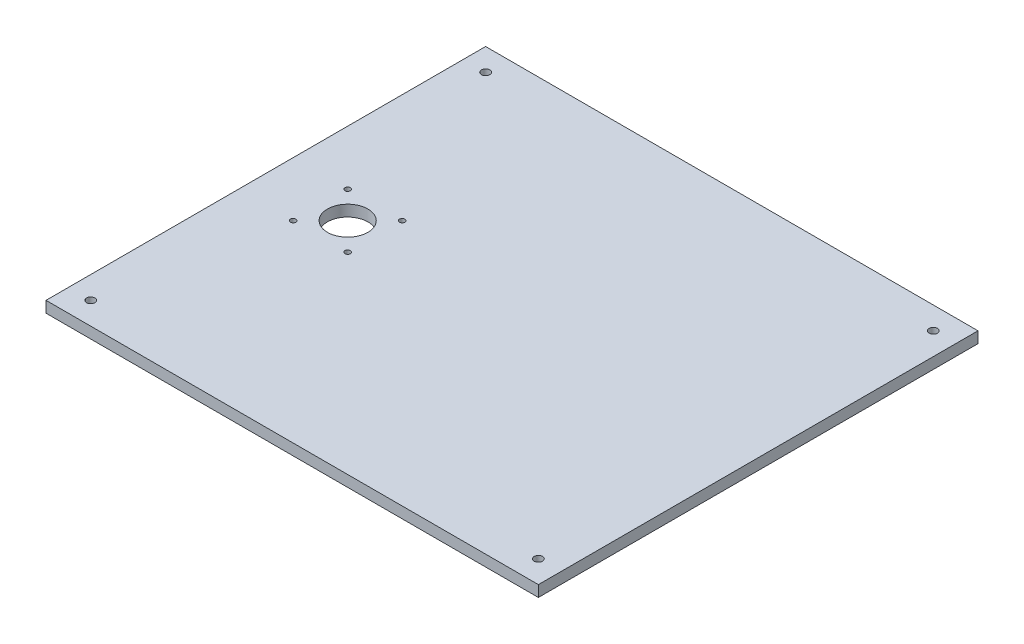
ISO-10303-21;
HEADER;
FILE_DESCRIPTION(('STEP AP214'),'2;1');
FILE_NAME('part.step','',(''),(''),'','','');
FILE_SCHEMA(('AUTOMOTIVE_DESIGN { 1 0 10303 214 1 1 1 1 }'));
ENDSEC;
DATA;
#1=APPLICATION_CONTEXT('core data for automotive mechanical design processes');
#2=APPLICATION_PROTOCOL_DEFINITION('international standard','automotive_design',2000,#1);
#3=PRODUCT_CONTEXT('',#1,'mechanical');
#4=PRODUCT('Part','Part','',(#3));
#5=PRODUCT_RELATED_PRODUCT_CATEGORY('part','',(#4));
#6=PRODUCT_DEFINITION_FORMATION('','',#4);
#7=PRODUCT_DEFINITION_CONTEXT('part definition',#1,'design');
#8=PRODUCT_DEFINITION('design','',#6,#7);
#9=PRODUCT_DEFINITION_SHAPE('','',#8);
#10=(LENGTH_UNIT() NAMED_UNIT(*) SI_UNIT(.MILLI.,.METRE.));
#11=(NAMED_UNIT(*) PLANE_ANGLE_UNIT() SI_UNIT($,.RADIAN.));
#12=(NAMED_UNIT(*) SI_UNIT($,.STERADIAN.) SOLID_ANGLE_UNIT());
#13=UNCERTAINTY_MEASURE_WITH_UNIT(LENGTH_MEASURE(1.E-05),#10,'distance_accuracy_value','');
#14=(GEOMETRIC_REPRESENTATION_CONTEXT(3) GLOBAL_UNCERTAINTY_ASSIGNED_CONTEXT((#13)) GLOBAL_UNIT_ASSIGNED_CONTEXT((#10,
#11,#12)) REPRESENTATION_CONTEXT('',''));
#15=CARTESIAN_POINT('',(0.,0.,0.));
#16=DIRECTION('',(0.,0.,1.));
#17=DIRECTION('',(1.,0.,0.));
#18=AXIS2_PLACEMENT_3D('',#15,#16,#17);
#19=CARTESIAN_POINT('',(140.,6.35,125.));
#20=DIRECTION('',(-1.,0.,0.));
#21=DIRECTION('',(0.,0.,1.));
#22=AXIS2_PLACEMENT_3D('',#19,#20,#21);
#23=PLANE('',#22);
#24=DIRECTION('',(0.,0.,-1.));
#25=VECTOR('',#24,1.);
#26=CARTESIAN_POINT('',(140.,0.,125.));
#27=LINE('',#26,#25);
#28=CARTESIAN_POINT('',(140.,0.,125.));
#29=VERTEX_POINT('',#28);
#30=CARTESIAN_POINT('',(140.,0.,-125.));
#31=VERTEX_POINT('',#30);
#32=EDGE_CURVE('E96',#29,#31,#27,.T.);
#33=ORIENTED_EDGE('',*,*,#32,.T.);
#34=DIRECTION('',(0.,-1.,0.));
#35=VECTOR('',#34,1.);
#36=CARTESIAN_POINT('',(140.,6.35,-125.));
#37=LINE('',#36,#35);
#38=CARTESIAN_POINT('',(140.,6.35,-125.));
#39=VERTEX_POINT('',#38);
#40=EDGE_CURVE('E11',#39,#31,#37,.T.);
#41=ORIENTED_EDGE('',*,*,#40,.F.);
#42=DIRECTION('',(0.,0.,-1.));
#43=VECTOR('',#42,1.);
#44=CARTESIAN_POINT('',(140.,6.35,125.));
#45=LINE('',#44,#43);
#46=CARTESIAN_POINT('',(140.,6.35,125.));
#47=VERTEX_POINT('',#46);
#48=EDGE_CURVE('E84',#47,#39,#45,.T.);
#49=ORIENTED_EDGE('',*,*,#48,.F.);
#50=DIRECTION('',(0.,-1.,0.));
#51=VECTOR('',#50,1.);
#52=CARTESIAN_POINT('',(140.,6.35,125.));
#53=LINE('',#52,#51);
#54=EDGE_CURVE('E92',#47,#29,#53,.T.);
#55=ORIENTED_EDGE('',*,*,#54,.T.);
#56=EDGE_LOOP('',(#33,#41,#49,#55));
#57=FACE_BOUND('',#56,.T.);
#58=ADVANCED_FACE('F33',(#57),#23,.F.);
#59=CARTESIAN_POINT('',(-140.,6.35,-125.));
#60=DIRECTION('',(0.,0.,1.));
#61=DIRECTION('',(1.,0.,0.));
#62=AXIS2_PLACEMENT_3D('',#59,#60,#61);
#63=PLANE('',#62);
#64=DIRECTION('',(-1.,0.,0.));
#65=VECTOR('',#64,1.);
#66=CARTESIAN_POINT('',(-140.,0.,-125.));
#67=LINE('',#66,#65);
#68=CARTESIAN_POINT('',(-140.,0.,-125.));
#69=VERTEX_POINT('',#68);
#70=EDGE_CURVE('E88',#31,#69,#67,.T.);
#71=ORIENTED_EDGE('',*,*,#70,.T.);
#72=DIRECTION('',(0.,-1.,0.));
#73=VECTOR('',#72,1.);
#74=CARTESIAN_POINT('',(-140.,6.35,-125.));
#75=LINE('',#74,#73);
#76=CARTESIAN_POINT('',(-140.,6.35,-125.));
#77=VERTEX_POINT('',#76);
#78=EDGE_CURVE('E41',#77,#69,#75,.T.);
#79=ORIENTED_EDGE('',*,*,#78,.F.);
#80=DIRECTION('',(-1.,0.,0.));
#81=VECTOR('',#80,1.);
#82=CARTESIAN_POINT('',(-140.,6.35,-125.));
#83=LINE('',#82,#81);
#84=EDGE_CURVE('E79',#39,#77,#83,.T.);
#85=ORIENTED_EDGE('',*,*,#84,.F.);
#86=ORIENTED_EDGE('',*,*,#40,.T.);
#87=EDGE_LOOP('',(#71,#79,#85,#86));
#88=FACE_BOUND('',#87,.T.);
#89=ADVANCED_FACE('F87',(#88),#63,.F.);
#90=CARTESIAN_POINT('',(-140.,6.35,125.));
#91=DIRECTION('',(1.,0.,0.));
#92=DIRECTION('',(0.,0.,-1.));
#93=AXIS2_PLACEMENT_3D('',#90,#91,#92);
#94=PLANE('',#93);
#95=DIRECTION('',(0.,0.,1.));
#96=VECTOR('',#95,1.);
#97=CARTESIAN_POINT('',(-140.,0.,125.));
#98=LINE('',#97,#96);
#99=CARTESIAN_POINT('',(-140.,0.,125.));
#100=VERTEX_POINT('',#99);
#101=EDGE_CURVE('E66',#69,#100,#98,.T.);
#102=ORIENTED_EDGE('',*,*,#101,.T.);
#103=DIRECTION('',(0.,-1.,0.));
#104=VECTOR('',#103,1.);
#105=CARTESIAN_POINT('',(-140.,6.35,125.));
#106=LINE('',#105,#104);
#107=CARTESIAN_POINT('',(-140.,6.35,125.));
#108=VERTEX_POINT('',#107);
#109=EDGE_CURVE('E89',#108,#100,#106,.T.);
#110=ORIENTED_EDGE('',*,*,#109,.F.);
#111=DIRECTION('',(0.,0.,1.));
#112=VECTOR('',#111,1.);
#113=CARTESIAN_POINT('',(-140.,6.35,125.));
#114=LINE('',#113,#112);
#115=EDGE_CURVE('E82',#77,#108,#114,.T.);
#116=ORIENTED_EDGE('',*,*,#115,.F.);
#117=ORIENTED_EDGE('',*,*,#78,.T.);
#118=EDGE_LOOP('',(#102,#110,#116,#117));
#119=FACE_BOUND('',#118,.T.);
#120=ADVANCED_FACE('F90',(#119),#94,.F.);
#121=CARTESIAN_POINT('',(-140.,6.35,125.));
#122=DIRECTION('',(0.,0.,-1.));
#123=DIRECTION('',(-1.,0.,0.));
#124=AXIS2_PLACEMENT_3D('',#121,#122,#123);
#125=PLANE('',#124);
#126=DIRECTION('',(1.,0.,0.));
#127=VECTOR('',#126,1.);
#128=CARTESIAN_POINT('',(-140.,0.,125.));
#129=LINE('',#128,#127);
#130=EDGE_CURVE('E72',#100,#29,#129,.T.);
#131=ORIENTED_EDGE('',*,*,#130,.T.);
#132=ORIENTED_EDGE('',*,*,#54,.F.);
#133=DIRECTION('',(1.,0.,0.));
#134=VECTOR('',#133,1.);
#135=CARTESIAN_POINT('',(-140.,6.35,125.));
#136=LINE('',#135,#134);
#137=EDGE_CURVE('E49',#108,#47,#136,.T.);
#138=ORIENTED_EDGE('',*,*,#137,.F.);
#139=ORIENTED_EDGE('',*,*,#109,.T.);
#140=EDGE_LOOP('',(#131,#132,#138,#139));
#141=FACE_BOUND('',#140,.T.);
#142=ADVANCED_FACE('F104',(#141),#125,.F.);
#143=CARTESIAN_POINT('',(0.,6.35,0.));
#144=DIRECTION('',(0.,-1.,0.));
#145=DIRECTION('',(0.,0.,-1.));
#146=AXIS2_PLACEMENT_3D('',#143,#144,#145);
#147=PLANE('',#146);
#148=CARTESIAN_POINT('',(-77.9499999999999,6.35,-15.5));
#149=DIRECTION('',(0.,1.,0.));
#150=DIRECTION('',(0.,0.,1.));
#151=AXIS2_PLACEMENT_3D('',#148,#149,#150);
#152=CIRCLE('',#151,1.54999999999999);
#153=CARTESIAN_POINT('',(-77.9499999999999,6.35,-13.95));
#154=VERTEX_POINT('',#153);
#155=EDGE_CURVE('E140',#154,#154,#152,.T.);
#156=ORIENTED_EDGE('',*,*,#155,.F.);
#157=EDGE_LOOP('',(#156));
#158=FACE_BOUND('',#157,.T.);
#159=CARTESIAN_POINT('',(-108.95,6.35,-15.5));
#160=DIRECTION('',(0.,1.,0.));
#161=DIRECTION('',(0.,0.,1.));
#162=AXIS2_PLACEMENT_3D('',#159,#160,#161);
#163=CIRCLE('',#162,1.54999999999999);
#164=CARTESIAN_POINT('',(-108.95,6.35,-13.95));
#165=VERTEX_POINT('',#164);
#166=EDGE_CURVE('E146',#165,#165,#163,.T.);
#167=ORIENTED_EDGE('',*,*,#166,.F.);
#168=EDGE_LOOP('',(#167));
#169=FACE_BOUND('',#168,.T.);
#170=CARTESIAN_POINT('',(-108.95,6.35,15.5));
#171=DIRECTION('',(0.,1.,0.));
#172=DIRECTION('',(0.,0.,1.));
#173=AXIS2_PLACEMENT_3D('',#170,#171,#172);
#174=CIRCLE('',#173,1.54999999999999);
#175=CARTESIAN_POINT('',(-108.95,6.35,17.05));
#176=VERTEX_POINT('',#175);
#177=EDGE_CURVE('E152',#176,#176,#174,.T.);
#178=ORIENTED_EDGE('',*,*,#177,.F.);
#179=EDGE_LOOP('',(#178));
#180=FACE_BOUND('',#179,.T.);
#181=CARTESIAN_POINT('',(-93.4499999999999,6.35,0.));
#182=DIRECTION('',(0.,1.,0.));
#183=DIRECTION('',(0.,0.,1.));
#184=AXIS2_PLACEMENT_3D('',#181,#182,#183);
#185=CIRCLE('',#184,11.5);
#186=CARTESIAN_POINT('',(-93.4499999999999,6.35,11.5));
#187=VERTEX_POINT('',#186);
#188=EDGE_CURVE('E158',#187,#187,#185,.T.);
#189=ORIENTED_EDGE('',*,*,#188,.F.);
#190=EDGE_LOOP('',(#189));
#191=FACE_BOUND('',#190,.T.);
#192=CARTESIAN_POINT('',(-77.9499999999999,6.35,15.5));
#193=DIRECTION('',(0.,1.,0.));
#194=DIRECTION('',(0.,0.,1.));
#195=AXIS2_PLACEMENT_3D('',#192,#193,#194);
#196=CIRCLE('',#195,1.55000000000001);
#197=CARTESIAN_POINT('',(-77.9499999999999,6.35,17.05));
#198=VERTEX_POINT('',#197);
#199=EDGE_CURVE('E134',#198,#198,#196,.T.);
#200=ORIENTED_EDGE('',*,*,#199,.F.);
#201=EDGE_LOOP('',(#200));
#202=FACE_BOUND('',#201,.T.);
#203=CARTESIAN_POINT('',(127.3,6.35,112.3));
#204=DIRECTION('',(0.,-1.,0.));
#205=DIRECTION('',(0.,0.,1.));
#206=AXIS2_PLACEMENT_3D('',#203,#204,#205);
#207=CIRCLE('',#206,2.38125);
#208=CARTESIAN_POINT('',(127.3,6.35,114.68125));
#209=VERTEX_POINT('',#208);
#210=EDGE_CURVE('E128',#209,#209,#207,.T.);
#211=ORIENTED_EDGE('',*,*,#210,.T.);
#212=EDGE_LOOP('',(#211));
#213=FACE_BOUND('',#212,.T.);
#214=CARTESIAN_POINT('',(127.3,6.35,-112.3));
#215=DIRECTION('',(0.,1.,0.));
#216=DIRECTION('',(0.,0.,-1.));
#217=AXIS2_PLACEMENT_3D('',#214,#215,#216);
#218=CIRCLE('',#217,2.38125);
#219=CARTESIAN_POINT('',(127.3,6.35,-114.68125));
#220=VERTEX_POINT('',#219);
#221=EDGE_CURVE('E122',#220,#220,#218,.T.);
#222=ORIENTED_EDGE('',*,*,#221,.F.);
#223=EDGE_LOOP('',(#222));
#224=FACE_BOUND('',#223,.T.);
#225=CARTESIAN_POINT('',(-127.3,6.35,-112.3));
#226=DIRECTION('',(0.,-1.,0.));
#227=DIRECTION('',(0.,0.,-1.));
#228=AXIS2_PLACEMENT_3D('',#225,#226,#227);
#229=CIRCLE('',#228,2.38125);
#230=CARTESIAN_POINT('',(-127.3,6.35,-114.68125));
#231=VERTEX_POINT('',#230);
#232=EDGE_CURVE('E116',#231,#231,#229,.T.);
#233=ORIENTED_EDGE('',*,*,#232,.T.);
#234=EDGE_LOOP('',(#233));
#235=FACE_BOUND('',#234,.T.);
#236=CARTESIAN_POINT('',(-127.3,6.35,112.3));
#237=DIRECTION('',(0.,1.,0.));
#238=DIRECTION('',(0.,0.,1.));
#239=AXIS2_PLACEMENT_3D('',#236,#237,#238);
#240=CIRCLE('',#239,2.38125);
#241=CARTESIAN_POINT('',(-127.3,6.35,114.68125));
#242=VERTEX_POINT('',#241);
#243=EDGE_CURVE('E110',#242,#242,#240,.T.);
#244=ORIENTED_EDGE('',*,*,#243,.F.);
#245=EDGE_LOOP('',(#244));
#246=FACE_BOUND('',#245,.T.);
#247=ORIENTED_EDGE('',*,*,#48,.T.);
#248=ORIENTED_EDGE('',*,*,#84,.T.);
#249=ORIENTED_EDGE('',*,*,#115,.T.);
#250=ORIENTED_EDGE('',*,*,#137,.T.);
#251=EDGE_LOOP('',(#247,#248,#249,#250));
#252=FACE_BOUND('',#251,.T.);
#253=ADVANCED_FACE('F80',(#158,#169,#180,#191,#202,#213,#224,#235,#246,#252),#147,.F.);
#254=CARTESIAN_POINT('',(0.,0.,0.));
#255=DIRECTION('',(0.,-1.,0.));
#256=DIRECTION('',(0.,0.,-1.));
#257=AXIS2_PLACEMENT_3D('',#254,#255,#256);
#258=PLANE('',#257);
#259=CARTESIAN_POINT('',(-77.9499999999999,0.,-15.5));
#260=DIRECTION('',(0.,1.,0.));
#261=DIRECTION('',(0.,0.,1.));
#262=AXIS2_PLACEMENT_3D('',#259,#260,#261);
#263=CIRCLE('',#262,1.54999999999999);
#264=CARTESIAN_POINT('',(-77.9499999999999,0.,-13.95));
#265=VERTEX_POINT('',#264);
#266=EDGE_CURVE('E143',#265,#265,#263,.T.);
#267=ORIENTED_EDGE('',*,*,#266,.T.);
#268=EDGE_LOOP('',(#267));
#269=FACE_BOUND('',#268,.T.);
#270=CARTESIAN_POINT('',(-108.95,0.,-15.5));
#271=DIRECTION('',(0.,1.,0.));
#272=DIRECTION('',(0.,0.,1.));
#273=AXIS2_PLACEMENT_3D('',#270,#271,#272);
#274=CIRCLE('',#273,1.54999999999999);
#275=CARTESIAN_POINT('',(-108.95,0.,-13.95));
#276=VERTEX_POINT('',#275);
#277=EDGE_CURVE('E149',#276,#276,#274,.T.);
#278=ORIENTED_EDGE('',*,*,#277,.T.);
#279=EDGE_LOOP('',(#278));
#280=FACE_BOUND('',#279,.T.);
#281=CARTESIAN_POINT('',(-108.95,0.,15.5));
#282=DIRECTION('',(0.,1.,0.));
#283=DIRECTION('',(0.,0.,1.));
#284=AXIS2_PLACEMENT_3D('',#281,#282,#283);
#285=CIRCLE('',#284,1.54999999999999);
#286=CARTESIAN_POINT('',(-108.95,0.,17.05));
#287=VERTEX_POINT('',#286);
#288=EDGE_CURVE('E155',#287,#287,#285,.T.);
#289=ORIENTED_EDGE('',*,*,#288,.T.);
#290=EDGE_LOOP('',(#289));
#291=FACE_BOUND('',#290,.T.);
#292=CARTESIAN_POINT('',(-93.4499999999999,0.,0.));
#293=DIRECTION('',(0.,1.,0.));
#294=DIRECTION('',(0.,0.,1.));
#295=AXIS2_PLACEMENT_3D('',#292,#293,#294);
#296=CIRCLE('',#295,11.5);
#297=CARTESIAN_POINT('',(-93.4499999999999,0.,11.5));
#298=VERTEX_POINT('',#297);
#299=EDGE_CURVE('E137',#298,#298,#296,.T.);
#300=ORIENTED_EDGE('',*,*,#299,.T.);
#301=EDGE_LOOP('',(#300));
#302=FACE_BOUND('',#301,.T.);
#303=CARTESIAN_POINT('',(-77.9499999999999,0.,15.5));
#304=DIRECTION('',(0.,1.,0.));
#305=DIRECTION('',(0.,0.,1.));
#306=AXIS2_PLACEMENT_3D('',#303,#304,#305);
#307=CIRCLE('',#306,1.55000000000001);
#308=CARTESIAN_POINT('',(-77.9499999999999,0.,17.05));
#309=VERTEX_POINT('',#308);
#310=EDGE_CURVE('E131',#309,#309,#307,.T.);
#311=ORIENTED_EDGE('',*,*,#310,.T.);
#312=EDGE_LOOP('',(#311));
#313=FACE_BOUND('',#312,.T.);
#314=CARTESIAN_POINT('',(127.3,0.,112.3));
#315=DIRECTION('',(0.,-1.,0.));
#316=DIRECTION('',(0.,0.,1.));
#317=AXIS2_PLACEMENT_3D('',#314,#315,#316);
#318=CIRCLE('',#317,2.38125);
#319=CARTESIAN_POINT('',(127.3,0.,114.68125));
#320=VERTEX_POINT('',#319);
#321=EDGE_CURVE('E125',#320,#320,#318,.T.);
#322=ORIENTED_EDGE('',*,*,#321,.F.);
#323=EDGE_LOOP('',(#322));
#324=FACE_BOUND('',#323,.T.);
#325=CARTESIAN_POINT('',(127.3,0.,-112.3));
#326=DIRECTION('',(0.,1.,0.));
#327=DIRECTION('',(0.,0.,-1.));
#328=AXIS2_PLACEMENT_3D('',#325,#326,#327);
#329=CIRCLE('',#328,2.38125);
#330=CARTESIAN_POINT('',(127.3,0.,-114.68125));
#331=VERTEX_POINT('',#330);
#332=EDGE_CURVE('E119',#331,#331,#329,.T.);
#333=ORIENTED_EDGE('',*,*,#332,.T.);
#334=EDGE_LOOP('',(#333));
#335=FACE_BOUND('',#334,.T.);
#336=CARTESIAN_POINT('',(-127.3,0.,-112.3));
#337=DIRECTION('',(0.,-1.,0.));
#338=DIRECTION('',(0.,0.,-1.));
#339=AXIS2_PLACEMENT_3D('',#336,#337,#338);
#340=CIRCLE('',#339,2.38125);
#341=CARTESIAN_POINT('',(-127.3,0.,-114.68125));
#342=VERTEX_POINT('',#341);
#343=EDGE_CURVE('E113',#342,#342,#340,.T.);
#344=ORIENTED_EDGE('',*,*,#343,.F.);
#345=EDGE_LOOP('',(#344));
#346=FACE_BOUND('',#345,.T.);
#347=CARTESIAN_POINT('',(-127.3,0.,112.3));
#348=DIRECTION('',(0.,1.,0.));
#349=DIRECTION('',(0.,0.,1.));
#350=AXIS2_PLACEMENT_3D('',#347,#348,#349);
#351=CIRCLE('',#350,2.38125);
#352=CARTESIAN_POINT('',(-127.3,0.,114.68125));
#353=VERTEX_POINT('',#352);
#354=EDGE_CURVE('E99',#353,#353,#351,.T.);
#355=ORIENTED_EDGE('',*,*,#354,.T.);
#356=EDGE_LOOP('',(#355));
#357=FACE_BOUND('',#356,.T.);
#358=ORIENTED_EDGE('',*,*,#32,.F.);
#359=ORIENTED_EDGE('',*,*,#130,.F.);
#360=ORIENTED_EDGE('',*,*,#101,.F.);
#361=ORIENTED_EDGE('',*,*,#70,.F.);
#362=EDGE_LOOP('',(#358,#359,#360,#361));
#363=FACE_BOUND('',#362,.T.);
#364=ADVANCED_FACE('F107',(#269,#280,#291,#302,#313,#324,#335,#346,#357,#363),#258,.T.);
#365=CARTESIAN_POINT('',(-127.3,0.,112.3));
#366=DIRECTION('',(0.,1.,0.));
#367=DIRECTION('',(0.,0.,1.));
#368=AXIS2_PLACEMENT_3D('',#365,#366,#367);
#369=CYLINDRICAL_SURFACE('',#368,2.38125);
#370=ORIENTED_EDGE('',*,*,#354,.F.);
#371=EDGE_LOOP('',(#370));
#372=FACE_BOUND('',#371,.T.);
#373=ORIENTED_EDGE('',*,*,#243,.T.);
#374=EDGE_LOOP('',(#373));
#375=FACE_BOUND('',#374,.T.);
#376=ADVANCED_FACE('F188',(#372,#375),#369,.F.);
#377=CARTESIAN_POINT('',(-127.3,0.,-112.3));
#378=DIRECTION('',(0.,1.,0.));
#379=DIRECTION('',(0.,0.,1.));
#380=AXIS2_PLACEMENT_3D('',#377,#378,#379);
#381=CYLINDRICAL_SURFACE('',#380,2.38125);
#382=ORIENTED_EDGE('',*,*,#343,.T.);
#383=EDGE_LOOP('',(#382));
#384=FACE_BOUND('',#383,.T.);
#385=ORIENTED_EDGE('',*,*,#232,.F.);
#386=EDGE_LOOP('',(#385));
#387=FACE_BOUND('',#386,.T.);
#388=ADVANCED_FACE('F190',(#384,#387),#381,.F.);
#389=CARTESIAN_POINT('',(127.3,0.,-112.3));
#390=DIRECTION('',(0.,1.,0.));
#391=DIRECTION('',(0.,0.,1.));
#392=AXIS2_PLACEMENT_3D('',#389,#390,#391);
#393=CYLINDRICAL_SURFACE('',#392,2.38125);
#394=ORIENTED_EDGE('',*,*,#332,.F.);
#395=EDGE_LOOP('',(#394));
#396=FACE_BOUND('',#395,.T.);
#397=ORIENTED_EDGE('',*,*,#221,.T.);
#398=EDGE_LOOP('',(#397));
#399=FACE_BOUND('',#398,.T.);
#400=ADVANCED_FACE('F197',(#396,#399),#393,.F.);
#401=CARTESIAN_POINT('',(127.3,0.,112.3));
#402=DIRECTION('',(0.,1.,0.));
#403=DIRECTION('',(0.,0.,1.));
#404=AXIS2_PLACEMENT_3D('',#401,#402,#403);
#405=CYLINDRICAL_SURFACE('',#404,2.38125);
#406=ORIENTED_EDGE('',*,*,#321,.T.);
#407=EDGE_LOOP('',(#406));
#408=FACE_BOUND('',#407,.T.);
#409=ORIENTED_EDGE('',*,*,#210,.F.);
#410=EDGE_LOOP('',(#409));
#411=FACE_BOUND('',#410,.T.);
#412=ADVANCED_FACE('F236',(#408,#411),#405,.F.);
#413=CARTESIAN_POINT('',(-77.9499999999999,0.,15.5));
#414=DIRECTION('',(0.,1.,0.));
#415=DIRECTION('',(0.,0.,1.));
#416=AXIS2_PLACEMENT_3D('',#413,#414,#415);
#417=CYLINDRICAL_SURFACE('',#416,1.55000000000001);
#418=ORIENTED_EDGE('',*,*,#310,.F.);
#419=EDGE_LOOP('',(#418));
#420=FACE_BOUND('',#419,.T.);
#421=ORIENTED_EDGE('',*,*,#199,.T.);
#422=EDGE_LOOP('',(#421));
#423=FACE_BOUND('',#422,.T.);
#424=ADVANCED_FACE('F170',(#420,#423),#417,.F.);
#425=CARTESIAN_POINT('',(-93.4499999999999,0.,0.));
#426=DIRECTION('',(0.,1.,0.));
#427=DIRECTION('',(0.,0.,1.));
#428=AXIS2_PLACEMENT_3D('',#425,#426,#427);
#429=CYLINDRICAL_SURFACE('',#428,11.5);
#430=ORIENTED_EDGE('',*,*,#299,.F.);
#431=EDGE_LOOP('',(#430));
#432=FACE_BOUND('',#431,.T.);
#433=ORIENTED_EDGE('',*,*,#188,.T.);
#434=EDGE_LOOP('',(#433));
#435=FACE_BOUND('',#434,.T.);
#436=ADVANCED_FACE('F166',(#432,#435),#429,.F.);
#437=CARTESIAN_POINT('',(-108.95,0.,15.5));
#438=DIRECTION('',(0.,1.,0.));
#439=DIRECTION('',(0.,0.,1.));
#440=AXIS2_PLACEMENT_3D('',#437,#438,#439);
#441=CYLINDRICAL_SURFACE('',#440,1.54999999999999);
#442=ORIENTED_EDGE('',*,*,#288,.F.);
#443=EDGE_LOOP('',(#442));
#444=FACE_BOUND('',#443,.T.);
#445=ORIENTED_EDGE('',*,*,#177,.T.);
#446=EDGE_LOOP('',(#445));
#447=FACE_BOUND('',#446,.T.);
#448=ADVANCED_FACE('F169',(#444,#447),#441,.F.);
#449=CARTESIAN_POINT('',(-108.95,0.,-15.5));
#450=DIRECTION('',(0.,1.,0.));
#451=DIRECTION('',(0.,0.,1.));
#452=AXIS2_PLACEMENT_3D('',#449,#450,#451);
#453=CYLINDRICAL_SURFACE('',#452,1.54999999999999);
#454=ORIENTED_EDGE('',*,*,#277,.F.);
#455=EDGE_LOOP('',(#454));
#456=FACE_BOUND('',#455,.T.);
#457=ORIENTED_EDGE('',*,*,#166,.T.);
#458=EDGE_LOOP('',(#457));
#459=FACE_BOUND('',#458,.T.);
#460=ADVANCED_FACE('F254',(#456,#459),#453,.F.);
#461=CARTESIAN_POINT('',(-77.9499999999999,0.,-15.5));
#462=DIRECTION('',(0.,1.,0.));
#463=DIRECTION('',(0.,0.,1.));
#464=AXIS2_PLACEMENT_3D('',#461,#462,#463);
#465=CYLINDRICAL_SURFACE('',#464,1.54999999999999);
#466=ORIENTED_EDGE('',*,*,#266,.F.);
#467=EDGE_LOOP('',(#466));
#468=FACE_BOUND('',#467,.T.);
#469=ORIENTED_EDGE('',*,*,#155,.T.);
#470=EDGE_LOOP('',(#469));
#471=FACE_BOUND('',#470,.T.);
#472=ADVANCED_FACE('F264',(#468,#471),#465,.F.);
#473=CLOSED_SHELL('',(#58,#89,#120,#142,#253,#364,#376,#388,#400,#412,#424,#436,#448,#460,#472));
#474=MANIFOLD_SOLID_BREP('B2',#473);
#475=ADVANCED_BREP_SHAPE_REPRESENTATION('',(#18,#474),#14);
#476=SHAPE_DEFINITION_REPRESENTATION(#9,#475);
ENDSEC;
END-ISO-10303-21;
